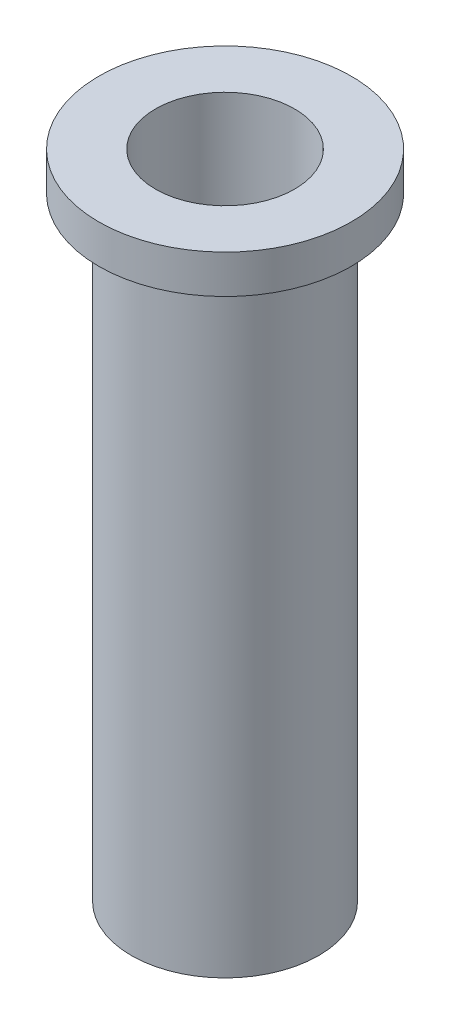
ISO-10303-21;
HEADER;
FILE_DESCRIPTION(('STEP AP214'),'2;1');
FILE_NAME('part.step','',(''),(''),'','','');
FILE_SCHEMA(('AUTOMOTIVE_DESIGN { 1 0 10303 214 1 1 1 1 }'));
ENDSEC;
DATA;
#1=APPLICATION_CONTEXT('core data for automotive mechanical design processes');
#2=APPLICATION_PROTOCOL_DEFINITION('international standard','automotive_design',2000,#1);
#3=PRODUCT_CONTEXT('',#1,'mechanical');
#4=PRODUCT('Part','Part','',(#3));
#5=PRODUCT_RELATED_PRODUCT_CATEGORY('part','',(#4));
#6=PRODUCT_DEFINITION_FORMATION('','',#4);
#7=PRODUCT_DEFINITION_CONTEXT('part definition',#1,'design');
#8=PRODUCT_DEFINITION('design','',#6,#7);
#9=PRODUCT_DEFINITION_SHAPE('','',#8);
#10=(LENGTH_UNIT() NAMED_UNIT(*) SI_UNIT(.MILLI.,.METRE.));
#11=(NAMED_UNIT(*) PLANE_ANGLE_UNIT() SI_UNIT($,.RADIAN.));
#12=(NAMED_UNIT(*) SI_UNIT($,.STERADIAN.) SOLID_ANGLE_UNIT());
#13=UNCERTAINTY_MEASURE_WITH_UNIT(LENGTH_MEASURE(1.E-05),#10,'distance_accuracy_value','');
#14=(GEOMETRIC_REPRESENTATION_CONTEXT(3) GLOBAL_UNCERTAINTY_ASSIGNED_CONTEXT((#13)) GLOBAL_UNIT_ASSIGNED_CONTEXT((#10,
#11,#12)) REPRESENTATION_CONTEXT('',''));
#15=CARTESIAN_POINT('',(0.,0.,0.));
#16=DIRECTION('',(0.,0.,1.));
#17=DIRECTION('',(1.,0.,0.));
#18=AXIS2_PLACEMENT_3D('',#15,#16,#17);
#19=CARTESIAN_POINT('',(0.,15.1189591480687,0.));
#20=DIRECTION('',(0.,1.,0.));
#21=DIRECTION('',(0.,0.,1.));
#22=AXIS2_PLACEMENT_3D('',#19,#20,#21);
#23=CONICAL_SURFACE('',#22,5.4229,0.573136586407754);
#24=CARTESIAN_POINT('',(0.,9.21566811332946,0.));
#25=DIRECTION('',(0.,1.,0.));
#26=DIRECTION('',(0.,0.,1.));
#27=AXIS2_PLACEMENT_3D('',#24,#25,#26);
#28=CIRCLE('',#27,1.6129);
#29=CARTESIAN_POINT('',(0.,9.21566811332946,1.6129));
#30=VERTEX_POINT('',#29);
#31=EDGE_CURVE('E57',#30,#30,#28,.T.);
#32=ORIENTED_EDGE('',*,*,#31,.F.);
#33=EDGE_LOOP('',(#32));
#34=FACE_BOUND('',#33,.T.);
#35=CARTESIAN_POINT('',(0.,15.11808,0.));
#36=DIRECTION('',(0.,1.,0.));
#37=DIRECTION('',(0.,0.,1.));
#38=AXIS2_PLACEMENT_3D('',#35,#36,#37);
#39=CIRCLE('',#38,5.42233259545869);
#40=CARTESIAN_POINT('',(0.,15.11808,5.42233259545869));
#41=VERTEX_POINT('',#40);
#42=EDGE_CURVE('E41',#41,#41,#39,.F.);
#43=ORIENTED_EDGE('',*,*,#42,.F.);
#44=EDGE_LOOP('',(#43));
#45=FACE_BOUND('',#44,.T.);
#46=ADVANCED_FACE('F37',(#34,#45),#23,.F.);
#47=CARTESIAN_POINT('',(0.,50.8,0.));
#48=DIRECTION('',(0.,-1.,0.));
#49=DIRECTION('',(0.,0.,-1.));
#50=AXIS2_PLACEMENT_3D('',#47,#48,#49);
#51=CYLINDRICAL_SURFACE('',#50,7.3025);
#52=CARTESIAN_POINT('',(0.,0.,0.));
#53=DIRECTION('',(0.,1.,0.));
#54=DIRECTION('',(0.,0.,1.));
#55=AXIS2_PLACEMENT_3D('',#52,#53,#54);
#56=CIRCLE('',#55,7.3025);
#57=CARTESIAN_POINT('',(0.,0.,7.3025));
#58=VERTEX_POINT('',#57);
#59=EDGE_CURVE('E46',#58,#58,#56,.T.);
#60=ORIENTED_EDGE('',*,*,#59,.T.);
#61=EDGE_LOOP('',(#60));
#62=FACE_BOUND('',#61,.T.);
#63=CARTESIAN_POINT('',(0.,47.8,0.));
#64=DIRECTION('',(0.,1.,0.));
#65=DIRECTION('',(0.,0.,1.));
#66=AXIS2_PLACEMENT_3D('',#63,#64,#65);
#67=CIRCLE('',#66,7.3025);
#68=CARTESIAN_POINT('',(0.,47.8,7.3025));
#69=VERTEX_POINT('',#68);
#70=EDGE_CURVE('E10',#69,#69,#67,.T.);
#71=ORIENTED_EDGE('',*,*,#70,.F.);
#72=EDGE_LOOP('',(#71));
#73=FACE_BOUND('',#72,.T.);
#74=ADVANCED_FACE('F39',(#62,#73),#51,.T.);
#75=CARTESIAN_POINT('',(0.,50.8,0.));
#76=DIRECTION('',(0.,1.,0.));
#77=DIRECTION('',(0.,0.,1.));
#78=AXIS2_PLACEMENT_3D('',#75,#76,#77);
#79=PLANE('',#78);
#80=CARTESIAN_POINT('',(0.,50.8,0.));
#81=DIRECTION('',(0.,1.,0.));
#82=DIRECTION('',(0.,0.,1.));
#83=AXIS2_PLACEMENT_3D('',#80,#81,#82);
#84=CIRCLE('',#83,5.4229);
#85=CARTESIAN_POINT('',(0.,50.8,5.4229));
#86=VERTEX_POINT('',#85);
#87=EDGE_CURVE('E69',#86,#86,#84,.T.);
#88=ORIENTED_EDGE('',*,*,#87,.F.);
#89=EDGE_LOOP('',(#88));
#90=FACE_BOUND('',#89,.T.);
#91=CARTESIAN_POINT('',(0.,50.8,0.));
#92=DIRECTION('',(0.,1.,0.));
#93=DIRECTION('',(0.,0.,1.));
#94=AXIS2_PLACEMENT_3D('',#91,#92,#93);
#95=CIRCLE('',#94,9.8425);
#96=CARTESIAN_POINT('',(0.,50.8,9.8425));
#97=VERTEX_POINT('',#96);
#98=EDGE_CURVE('E65',#97,#97,#95,.T.);
#99=ORIENTED_EDGE('',*,*,#98,.T.);
#100=EDGE_LOOP('',(#99));
#101=FACE_BOUND('',#100,.T.);
#102=ADVANCED_FACE('F90',(#90,#101),#79,.T.);
#103=CARTESIAN_POINT('',(0.,0.,0.));
#104=DIRECTION('',(0.,1.,0.));
#105=DIRECTION('',(0.,0.,1.));
#106=AXIS2_PLACEMENT_3D('',#103,#104,#105);
#107=PLANE('',#106);
#108=CARTESIAN_POINT('',(0.,0.,0.));
#109=DIRECTION('',(0.,1.,0.));
#110=DIRECTION('',(0.,0.,1.));
#111=AXIS2_PLACEMENT_3D('',#108,#109,#110);
#112=CIRCLE('',#111,1.6129);
#113=CARTESIAN_POINT('',(0.,0.,1.6129));
#114=VERTEX_POINT('',#113);
#115=EDGE_CURVE('E51',#114,#114,#112,.F.);
#116=ORIENTED_EDGE('',*,*,#115,.F.);
#117=EDGE_LOOP('',(#116));
#118=FACE_BOUND('',#117,.T.);
#119=ORIENTED_EDGE('',*,*,#59,.F.);
#120=EDGE_LOOP('',(#119));
#121=FACE_BOUND('',#120,.T.);
#122=ADVANCED_FACE('F100',(#118,#121),#107,.F.);
#123=CARTESIAN_POINT('',(0.,-4.56197010950313,0.));
#124=DIRECTION('',(0.,1.,0.));
#125=DIRECTION('',(0.,0.,1.));
#126=AXIS2_PLACEMENT_3D('',#123,#124,#125);
#127=CYLINDRICAL_SURFACE('',#126,1.6129);
#128=ORIENTED_EDGE('',*,*,#31,.T.);
#129=EDGE_LOOP('',(#128));
#130=FACE_BOUND('',#129,.T.);
#131=ORIENTED_EDGE('',*,*,#115,.T.);
#132=EDGE_LOOP('',(#131));
#133=FACE_BOUND('',#132,.T.);
#134=ADVANCED_FACE('F97',(#130,#133),#127,.F.);
#135=CARTESIAN_POINT('',(0.,47.8,-7.3025));
#136=DIRECTION('',(0.,1.,0.));
#137=DIRECTION('',(0.,0.,1.));
#138=AXIS2_PLACEMENT_3D('',#135,#136,#137);
#139=PLANE('',#138);
#140=CARTESIAN_POINT('',(0.,47.8,0.));
#141=DIRECTION('',(0.,1.,0.));
#142=DIRECTION('',(0.,0.,1.));
#143=AXIS2_PLACEMENT_3D('',#140,#141,#142);
#144=CIRCLE('',#143,9.8425);
#145=CARTESIAN_POINT('',(0.,47.8,9.8425));
#146=VERTEX_POINT('',#145);
#147=EDGE_CURVE('E61',#146,#146,#144,.T.);
#148=ORIENTED_EDGE('',*,*,#147,.F.);
#149=EDGE_LOOP('',(#148));
#150=FACE_BOUND('',#149,.T.);
#151=ORIENTED_EDGE('',*,*,#70,.T.);
#152=EDGE_LOOP('',(#151));
#153=FACE_BOUND('',#152,.T.);
#154=ADVANCED_FACE('F95',(#150,#153),#139,.F.);
#155=CARTESIAN_POINT('',(0.,34.671,0.));
#156=DIRECTION('',(0.,1.,0.));
#157=DIRECTION('',(0.,0.,1.));
#158=AXIS2_PLACEMENT_3D('',#155,#156,#157);
#159=CYLINDRICAL_SURFACE('',#158,9.8425);
#160=ORIENTED_EDGE('',*,*,#98,.F.);
#161=EDGE_LOOP('',(#160));
#162=FACE_BOUND('',#161,.T.);
#163=ORIENTED_EDGE('',*,*,#147,.T.);
#164=EDGE_LOOP('',(#163));
#165=FACE_BOUND('',#164,.T.);
#166=ADVANCED_FACE('F126',(#162,#165),#159,.T.);
#167=CARTESIAN_POINT('',(0.,15.11808,0.));
#168=DIRECTION('',(0.,1.,0.));
#169=DIRECTION('',(0.,0.,1.));
#170=AXIS2_PLACEMENT_3D('',#167,#168,#169);
#171=CYLINDRICAL_SURFACE('',#170,5.4229);
#172=CARTESIAN_POINT('',(0.,15.11808,0.));
#173=DIRECTION('',(0.,1.,0.));
#174=DIRECTION('',(0.,0.,1.));
#175=AXIS2_PLACEMENT_3D('',#172,#173,#174);
#176=CIRCLE('',#175,5.4229);
#177=CARTESIAN_POINT('',(0.,15.11808,5.4229));
#178=VERTEX_POINT('',#177);
#179=EDGE_CURVE('E73',#178,#178,#176,.T.);
#180=ORIENTED_EDGE('',*,*,#179,.F.);
#181=EDGE_LOOP('',(#180));
#182=FACE_BOUND('',#181,.T.);
#183=ORIENTED_EDGE('',*,*,#87,.T.);
#184=EDGE_LOOP('',(#183));
#185=FACE_BOUND('',#184,.T.);
#186=ADVANCED_FACE('F133',(#182,#185),#171,.F.);
#187=CARTESIAN_POINT('',(0.,15.11808,0.));
#188=DIRECTION('',(0.,1.,0.));
#189=DIRECTION('',(0.,0.,1.));
#190=AXIS2_PLACEMENT_3D('',#187,#188,#189);
#191=PLANE('',#190);
#192=ORIENTED_EDGE('',*,*,#179,.T.);
#193=EDGE_LOOP('',(#192));
#194=FACE_BOUND('',#193,.T.);
#195=ORIENTED_EDGE('',*,*,#42,.T.);
#196=EDGE_LOOP('',(#195));
#197=FACE_BOUND('',#196,.T.);
#198=ADVANCED_FACE('F82',(#194,#197),#191,.T.);
#199=CLOSED_SHELL('',(#46,#74,#102,#122,#134,#154,#166,#186,#198));
#200=MANIFOLD_SOLID_BREP('B2',#199);
#201=ADVANCED_BREP_SHAPE_REPRESENTATION('',(#18,#200),#14);
#202=SHAPE_DEFINITION_REPRESENTATION(#9,#201);
ENDSEC;
END-ISO-10303-21;
